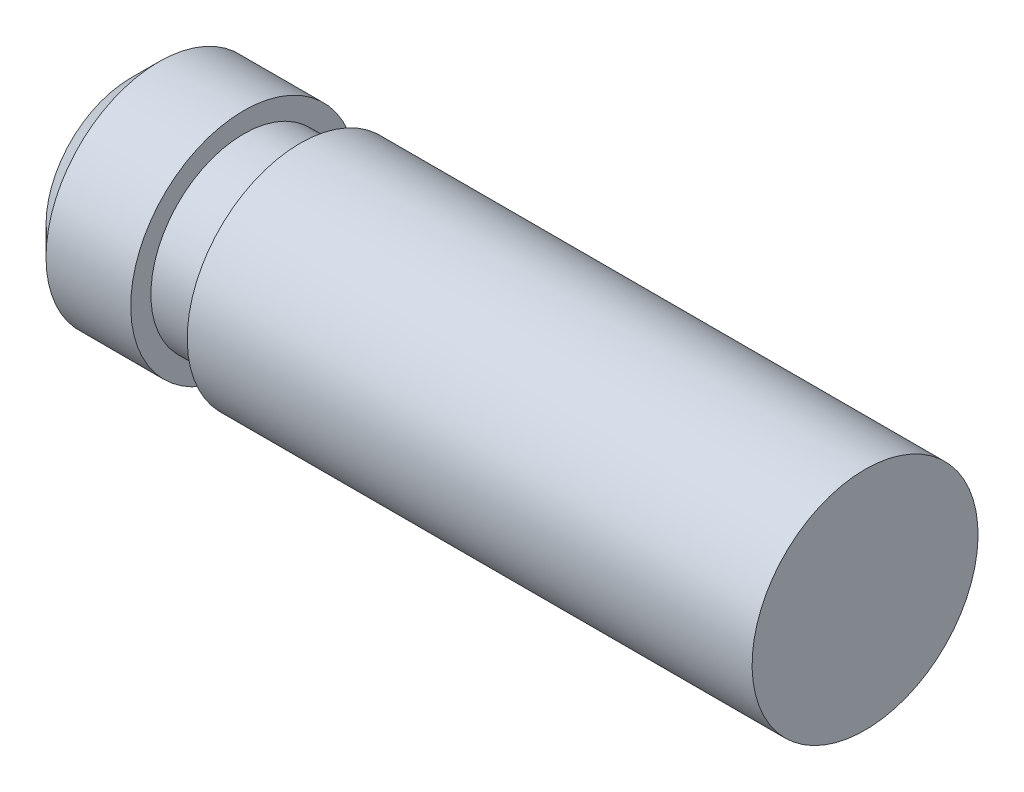
ISO-10303-21;
HEADER;
FILE_DESCRIPTION(('STEP AP214'),'2;1');
FILE_NAME('part.step','',(''),(''),'','','');
FILE_SCHEMA(('AUTOMOTIVE_DESIGN { 1 0 10303 214 1 1 1 1 }'));
ENDSEC;
DATA;
#1=APPLICATION_CONTEXT('core data for automotive mechanical design processes');
#2=APPLICATION_PROTOCOL_DEFINITION('international standard','automotive_design',2000,#1);
#3=PRODUCT_CONTEXT('',#1,'mechanical');
#4=PRODUCT('Part','Part','',(#3));
#5=PRODUCT_RELATED_PRODUCT_CATEGORY('part','',(#4));
#6=PRODUCT_DEFINITION_FORMATION('','',#4);
#7=PRODUCT_DEFINITION_CONTEXT('part definition',#1,'design');
#8=PRODUCT_DEFINITION('design','',#6,#7);
#9=PRODUCT_DEFINITION_SHAPE('','',#8);
#10=(LENGTH_UNIT() NAMED_UNIT(*) SI_UNIT(.MILLI.,.METRE.));
#11=(NAMED_UNIT(*) PLANE_ANGLE_UNIT() SI_UNIT($,.RADIAN.));
#12=(NAMED_UNIT(*) SI_UNIT($,.STERADIAN.) SOLID_ANGLE_UNIT());
#13=UNCERTAINTY_MEASURE_WITH_UNIT(LENGTH_MEASURE(1.E-05),#10,'distance_accuracy_value','');
#14=(GEOMETRIC_REPRESENTATION_CONTEXT(3) GLOBAL_UNCERTAINTY_ASSIGNED_CONTEXT((#13)) GLOBAL_UNIT_ASSIGNED_CONTEXT((#10,
#11,#12)) REPRESENTATION_CONTEXT('',''));
#15=CARTESIAN_POINT('',(0.,0.,0.));
#16=DIRECTION('',(0.,0.,1.));
#17=DIRECTION('',(1.,0.,0.));
#18=AXIS2_PLACEMENT_3D('',#15,#16,#17);
#19=CARTESIAN_POINT('',(6.5,-0.818539415837531,0.));
#20=DIRECTION('',(1.,0.,0.));
#21=DIRECTION('',(0.,1.,0.));
#22=AXIS2_PLACEMENT_3D('',#19,#20,#21);
#23=CYLINDRICAL_SURFACE('',#22,2.);
#24=CARTESIAN_POINT('',(-6.,-0.818539415837533,0.));
#25=DIRECTION('',(-1.,0.,0.));
#26=DIRECTION('',(0.,-1.,0.));
#27=AXIS2_PLACEMENT_3D('',#24,#25,#26);
#28=CIRCLE('',#27,2.);
#29=CARTESIAN_POINT('',(-6.,-2.81853941583753,0.));
#30=VERTEX_POINT('',#29);
#31=EDGE_CURVE('E41',#30,#30,#28,.F.);
#32=ORIENTED_EDGE('',*,*,#31,.T.);
#33=EDGE_LOOP('',(#32));
#34=FACE_BOUND('',#33,.T.);
#35=CARTESIAN_POINT('',(-4.5,-0.818539415837533,0.));
#36=DIRECTION('',(1.,0.,0.));
#37=DIRECTION('',(0.,1.,0.));
#38=AXIS2_PLACEMENT_3D('',#35,#36,#37);
#39=CIRCLE('',#38,2.);
#40=CARTESIAN_POINT('',(-4.5,1.18146058416247,0.));
#41=VERTEX_POINT('',#40);
#42=EDGE_CURVE('E45',#41,#41,#39,.T.);
#43=ORIENTED_EDGE('',*,*,#42,.F.);
#44=EDGE_LOOP('',(#43));
#45=FACE_BOUND('',#44,.T.);
#46=ADVANCED_FACE('F33',(#34,#45),#23,.T.);
#47=CARTESIAN_POINT('',(-4.5,1.18146058416247,0.));
#48=DIRECTION('',(1.,0.,0.));
#49=DIRECTION('',(0.,1.,0.));
#50=AXIS2_PLACEMENT_3D('',#47,#48,#49);
#51=PLANE('',#50);
#52=ORIENTED_EDGE('',*,*,#42,.T.);
#53=EDGE_LOOP('',(#52));
#54=FACE_BOUND('',#53,.T.);
#55=CARTESIAN_POINT('',(-4.5,-0.818539415837533,0.));
#56=DIRECTION('',(1.,0.,0.));
#57=DIRECTION('',(0.,1.,0.));
#58=AXIS2_PLACEMENT_3D('',#55,#56,#57);
#59=CIRCLE('',#58,1.64335486762435);
#60=CARTESIAN_POINT('',(-4.5,0.824815451786819,0.));
#61=VERTEX_POINT('',#60);
#62=EDGE_CURVE('E49',#61,#61,#59,.T.);
#63=ORIENTED_EDGE('',*,*,#62,.F.);
#64=EDGE_LOOP('',(#63));
#65=FACE_BOUND('',#64,.T.);
#66=ADVANCED_FACE('F81',(#54,#65),#51,.T.);
#67=CARTESIAN_POINT('',(6.5,-0.818539415837531,0.));
#68=DIRECTION('',(1.,0.,0.));
#69=DIRECTION('',(0.,1.,0.));
#70=AXIS2_PLACEMENT_3D('',#67,#68,#69);
#71=CYLINDRICAL_SURFACE('',#70,1.64335486762435);
#72=ORIENTED_EDGE('',*,*,#62,.T.);
#73=EDGE_LOOP('',(#72));
#74=FACE_BOUND('',#73,.T.);
#75=CARTESIAN_POINT('',(-3.5,-0.818539415837533,0.));
#76=DIRECTION('',(1.,0.,0.));
#77=DIRECTION('',(0.,1.,0.));
#78=AXIS2_PLACEMENT_3D('',#75,#76,#77);
#79=CIRCLE('',#78,1.64335486762435);
#80=CARTESIAN_POINT('',(-3.5,0.824815451786819,0.));
#81=VERTEX_POINT('',#80);
#82=EDGE_CURVE('E54',#81,#81,#79,.T.);
#83=ORIENTED_EDGE('',*,*,#82,.F.);
#84=EDGE_LOOP('',(#83));
#85=FACE_BOUND('',#84,.T.);
#86=ADVANCED_FACE('F77',(#74,#85),#71,.T.);
#87=CARTESIAN_POINT('',(-3.5,0.824815451786819,0.));
#88=DIRECTION('',(-1.,0.,0.));
#89=DIRECTION('',(0.,-1.,0.));
#90=AXIS2_PLACEMENT_3D('',#87,#88,#89);
#91=PLANE('',#90);
#92=ORIENTED_EDGE('',*,*,#82,.T.);
#93=EDGE_LOOP('',(#92));
#94=FACE_BOUND('',#93,.T.);
#95=CARTESIAN_POINT('',(-3.5,-0.818539415837533,0.));
#96=DIRECTION('',(1.,0.,0.));
#97=DIRECTION('',(0.,1.,0.));
#98=AXIS2_PLACEMENT_3D('',#95,#96,#97);
#99=CIRCLE('',#98,2.);
#100=CARTESIAN_POINT('',(-3.5,1.18146058416247,0.));
#101=VERTEX_POINT('',#100);
#102=EDGE_CURVE('E57',#101,#101,#99,.T.);
#103=ORIENTED_EDGE('',*,*,#102,.F.);
#104=EDGE_LOOP('',(#103));
#105=FACE_BOUND('',#104,.T.);
#106=ADVANCED_FACE('F68',(#94,#105),#91,.T.);
#107=CARTESIAN_POINT('',(6.5,-0.818539415837531,0.));
#108=DIRECTION('',(1.,0.,0.));
#109=DIRECTION('',(0.,1.,0.));
#110=AXIS2_PLACEMENT_3D('',#107,#108,#109);
#111=CYLINDRICAL_SURFACE('',#110,2.);
#112=ORIENTED_EDGE('',*,*,#102,.T.);
#113=EDGE_LOOP('',(#112));
#114=FACE_BOUND('',#113,.T.);
#115=CARTESIAN_POINT('',(6.5,-0.818539415837531,0.));
#116=DIRECTION('',(1.,0.,0.));
#117=DIRECTION('',(0.,1.,0.));
#118=AXIS2_PLACEMENT_3D('',#115,#116,#117);
#119=CIRCLE('',#118,2.);
#120=CARTESIAN_POINT('',(6.5,1.18146058416247,0.));
#121=VERTEX_POINT('',#120);
#122=EDGE_CURVE('E60',#121,#121,#119,.T.);
#123=ORIENTED_EDGE('',*,*,#122,.F.);
#124=EDGE_LOOP('',(#123));
#125=FACE_BOUND('',#124,.T.);
#126=ADVANCED_FACE('F66',(#114,#125),#111,.T.);
#127=CARTESIAN_POINT('',(6.5,-0.818539415837531,0.));
#128=DIRECTION('',(1.,0.,0.));
#129=DIRECTION('',(0.,1.,0.));
#130=AXIS2_PLACEMENT_3D('',#127,#128,#129);
#131=PLANE('',#130);
#132=ORIENTED_EDGE('',*,*,#122,.T.);
#133=EDGE_LOOP('',(#132));
#134=FACE_BOUND('',#133,.T.);
#135=ADVANCED_FACE('F64',(#134),#131,.T.);
#136=CARTESIAN_POINT('',(-6.5,-0.818539415837533,0.));
#137=DIRECTION('',(-1.,0.,0.));
#138=DIRECTION('',(0.,-1.,0.));
#139=AXIS2_PLACEMENT_3D('',#136,#137,#138);
#140=PLANE('',#139);
#141=CARTESIAN_POINT('',(-6.5,-0.818539415837533,0.));
#142=DIRECTION('',(-1.,0.,0.));
#143=DIRECTION('',(0.,-1.,0.));
#144=AXIS2_PLACEMENT_3D('',#141,#142,#143);
#145=CIRCLE('',#144,1.5);
#146=CARTESIAN_POINT('',(-6.5,-2.31853941583753,0.));
#147=VERTEX_POINT('',#146);
#148=EDGE_CURVE('E10',#147,#147,#145,.T.);
#149=ORIENTED_EDGE('',*,*,#148,.T.);
#150=EDGE_LOOP('',(#149));
#151=FACE_BOUND('',#150,.T.);
#152=ADVANCED_FACE('F75',(#151),#140,.T.);
#153=CARTESIAN_POINT('',(-6.,-0.818539415837533,0.));
#154=DIRECTION('',(1.,0.,0.));
#155=DIRECTION('',(0.,1.,0.));
#156=AXIS2_PLACEMENT_3D('',#153,#154,#155);
#157=CONICAL_SURFACE('',#156,2.,0.78539816339745);
#158=ORIENTED_EDGE('',*,*,#148,.F.);
#159=EDGE_LOOP('',(#158));
#160=FACE_BOUND('',#159,.T.);
#161=ORIENTED_EDGE('',*,*,#31,.F.);
#162=EDGE_LOOP('',(#161));
#163=FACE_BOUND('',#162,.T.);
#164=ADVANCED_FACE('F36',(#160,#163),#157,.T.);
#165=CLOSED_SHELL('',(#46,#66,#86,#106,#126,#135,#152,#164));
#166=MANIFOLD_SOLID_BREP('B2',#165);
#167=ADVANCED_BREP_SHAPE_REPRESENTATION('',(#18,#166),#14);
#168=SHAPE_DEFINITION_REPRESENTATION(#9,#167);
ENDSEC;
END-ISO-10303-21;
